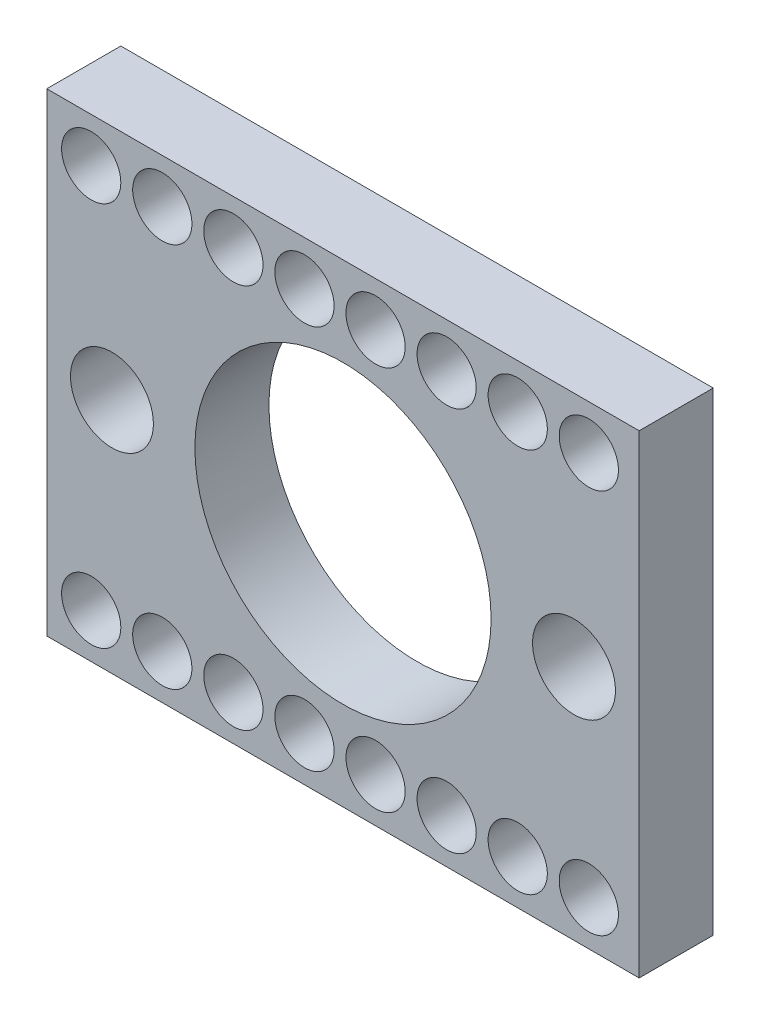
ISO-10303-21;
HEADER;
FILE_DESCRIPTION(('STEP AP214'),'2;1');
FILE_NAME('part.step','',(''),(''),'','','');
FILE_SCHEMA(('AUTOMOTIVE_DESIGN { 1 0 10303 214 1 1 1 1 }'));
ENDSEC;
DATA;
#1=APPLICATION_CONTEXT('core data for automotive mechanical design processes');
#2=APPLICATION_PROTOCOL_DEFINITION('international standard','automotive_design',2000,#1);
#3=PRODUCT_CONTEXT('',#1,'mechanical');
#4=PRODUCT('Part','Part','',(#3));
#5=PRODUCT_RELATED_PRODUCT_CATEGORY('part','',(#4));
#6=PRODUCT_DEFINITION_FORMATION('','',#4);
#7=PRODUCT_DEFINITION_CONTEXT('part definition',#1,'design');
#8=PRODUCT_DEFINITION('design','',#6,#7);
#9=PRODUCT_DEFINITION_SHAPE('','',#8);
#10=(LENGTH_UNIT() NAMED_UNIT(*) SI_UNIT(.MILLI.,.METRE.));
#11=(NAMED_UNIT(*) PLANE_ANGLE_UNIT() SI_UNIT($,.RADIAN.));
#12=(NAMED_UNIT(*) SI_UNIT($,.STERADIAN.) SOLID_ANGLE_UNIT());
#13=UNCERTAINTY_MEASURE_WITH_UNIT(LENGTH_MEASURE(1.E-05),#10,'distance_accuracy_value','');
#14=(GEOMETRIC_REPRESENTATION_CONTEXT(3) GLOBAL_UNCERTAINTY_ASSIGNED_CONTEXT((#13)) GLOBAL_UNIT_ASSIGNED_CONTEXT((#10,
#11,#12)) REPRESENTATION_CONTEXT('',''));
#15=CARTESIAN_POINT('',(0.,0.,0.));
#16=DIRECTION('',(0.,0.,1.));
#17=DIRECTION('',(1.,0.,0.));
#18=AXIS2_PLACEMENT_3D('',#15,#16,#17);
#19=CARTESIAN_POINT('',(-13.7458823529412,0.,3.175));
#20=DIRECTION('',(-1.,0.,0.));
#21=DIRECTION('',(0.,0.,1.));
#22=AXIS2_PLACEMENT_3D('',#19,#20,#21);
#23=PLANE('',#22);
#24=DIRECTION('',(0.,1.,0.));
#25=VECTOR('',#24,1.);
#26=CARTESIAN_POINT('',(-13.7458823529412,0.,0.));
#27=LINE('',#26,#25);
#28=CARTESIAN_POINT('',(-13.7458823529412,-10.16,0.));
#29=VERTEX_POINT('',#28);
#30=CARTESIAN_POINT('',(-13.7458823529412,10.16,0.));
#31=VERTEX_POINT('',#30);
#32=EDGE_CURVE('E126',#29,#31,#27,.T.);
#33=ORIENTED_EDGE('',*,*,#32,.F.);
#34=DIRECTION('',(0.,0.,-1.));
#35=VECTOR('',#34,1.);
#36=CARTESIAN_POINT('',(-13.7458823529412,-10.16,3.175));
#37=LINE('',#36,#35);
#38=CARTESIAN_POINT('',(-13.7458823529412,-10.16,3.175));
#39=VERTEX_POINT('',#38);
#40=EDGE_CURVE('E11',#39,#29,#37,.T.);
#41=ORIENTED_EDGE('',*,*,#40,.F.);
#42=DIRECTION('',(0.,1.,0.));
#43=VECTOR('',#42,1.);
#44=CARTESIAN_POINT('',(-13.7458823529412,0.,3.175));
#45=LINE('',#44,#43);
#46=CARTESIAN_POINT('',(-13.7458823529412,10.16,3.175));
#47=VERTEX_POINT('',#46);
#48=EDGE_CURVE('E103',#39,#47,#45,.T.);
#49=ORIENTED_EDGE('',*,*,#48,.T.);
#50=DIRECTION('',(0.,0.,-1.));
#51=VECTOR('',#50,1.);
#52=CARTESIAN_POINT('',(-13.7458823529412,10.16,3.175));
#53=LINE('',#52,#51);
#54=EDGE_CURVE('E80',#47,#31,#53,.T.);
#55=ORIENTED_EDGE('',*,*,#54,.T.);
#56=EDGE_LOOP('',(#33,#41,#49,#55));
#57=FACE_BOUND('',#56,.T.);
#58=ADVANCED_FACE('F39',(#57),#23,.T.);
#59=CARTESIAN_POINT('',(0.,-10.16,3.175));
#60=DIRECTION('',(0.,-1.,0.));
#61=DIRECTION('',(1.,0.,0.));
#62=AXIS2_PLACEMENT_3D('',#59,#60,#61);
#63=PLANE('',#62);
#64=DIRECTION('',(-1.,0.,0.));
#65=VECTOR('',#64,1.);
#66=CARTESIAN_POINT('',(0.,-10.16,0.));
#67=LINE('',#66,#65);
#68=CARTESIAN_POINT('',(11.6541176470588,-10.16,0.));
#69=VERTEX_POINT('',#68);
#70=EDGE_CURVE('E92',#69,#29,#67,.T.);
#71=ORIENTED_EDGE('',*,*,#70,.F.);
#72=DIRECTION('',(0.,0.,-1.));
#73=VECTOR('',#72,1.);
#74=CARTESIAN_POINT('',(11.6541176470588,-10.16,3.175));
#75=LINE('',#74,#73);
#76=CARTESIAN_POINT('',(11.6541176470588,-10.16,3.175));
#77=VERTEX_POINT('',#76);
#78=EDGE_CURVE('E49',#77,#69,#75,.T.);
#79=ORIENTED_EDGE('',*,*,#78,.F.);
#80=DIRECTION('',(-1.,0.,0.));
#81=VECTOR('',#80,1.);
#82=CARTESIAN_POINT('',(0.,-10.16,3.175));
#83=LINE('',#82,#81);
#84=EDGE_CURVE('E90',#77,#39,#83,.T.);
#85=ORIENTED_EDGE('',*,*,#84,.T.);
#86=ORIENTED_EDGE('',*,*,#40,.T.);
#87=EDGE_LOOP('',(#71,#79,#85,#86));
#88=FACE_BOUND('',#87,.T.);
#89=ADVANCED_FACE('F88',(#88),#63,.T.);
#90=CARTESIAN_POINT('',(11.6541176470588,0.,3.175));
#91=DIRECTION('',(-1.,0.,0.));
#92=DIRECTION('',(0.,-1.,0.));
#93=AXIS2_PLACEMENT_3D('',#90,#91,#92);
#94=PLANE('',#93);
#95=DIRECTION('',(0.,1.,0.));
#96=VECTOR('',#95,1.);
#97=CARTESIAN_POINT('',(11.6541176470588,0.,0.));
#98=LINE('',#97,#96);
#99=CARTESIAN_POINT('',(11.6541176470588,10.16,0.));
#100=VERTEX_POINT('',#99);
#101=EDGE_CURVE('E131',#69,#100,#98,.T.);
#102=ORIENTED_EDGE('',*,*,#101,.T.);
#103=DIRECTION('',(0.,0.,-1.));
#104=VECTOR('',#103,1.);
#105=CARTESIAN_POINT('',(11.6541176470588,10.16,3.175));
#106=LINE('',#105,#104);
#107=CARTESIAN_POINT('',(11.6541176470588,10.16,3.175));
#108=VERTEX_POINT('',#107);
#109=EDGE_CURVE('E96',#108,#100,#106,.T.);
#110=ORIENTED_EDGE('',*,*,#109,.F.);
#111=DIRECTION('',(0.,1.,0.));
#112=VECTOR('',#111,1.);
#113=CARTESIAN_POINT('',(11.6541176470588,0.,3.175));
#114=LINE('',#113,#112);
#115=EDGE_CURVE('E98',#77,#108,#114,.T.);
#116=ORIENTED_EDGE('',*,*,#115,.F.);
#117=ORIENTED_EDGE('',*,*,#78,.T.);
#118=EDGE_LOOP('',(#102,#110,#116,#117));
#119=FACE_BOUND('',#118,.T.);
#120=ADVANCED_FACE('F99',(#119),#94,.F.);
#121=CARTESIAN_POINT('',(-1.04588235294118,0.,3.175));
#122=DIRECTION('',(0.,0.,-1.));
#123=DIRECTION('',(-1.,0.,0.));
#124=AXIS2_PLACEMENT_3D('',#121,#122,#123);
#125=CYLINDRICAL_SURFACE('',#124,6.35);
#126=CARTESIAN_POINT('',(-1.04588235294118,0.,3.175));
#127=DIRECTION('',(0.,0.,1.));
#128=DIRECTION('',(1.,0.,0.));
#129=AXIS2_PLACEMENT_3D('',#126,#127,#128);
#130=CIRCLE('',#129,6.35);
#131=CARTESIAN_POINT('',(5.30411764705882,0.,3.175));
#132=VERTEX_POINT('',#131);
#133=EDGE_CURVE('E107',#132,#132,#130,.T.);
#134=ORIENTED_EDGE('',*,*,#133,.T.);
#135=EDGE_LOOP('',(#134));
#136=FACE_BOUND('',#135,.T.);
#137=CARTESIAN_POINT('',(-1.04588235294118,0.,0.));
#138=DIRECTION('',(0.,0.,1.));
#139=DIRECTION('',(1.,0.,0.));
#140=AXIS2_PLACEMENT_3D('',#137,#138,#139);
#141=CIRCLE('',#140,6.35);
#142=CARTESIAN_POINT('',(5.30411764705882,0.,0.));
#143=VERTEX_POINT('',#142);
#144=EDGE_CURVE('E122',#143,#143,#141,.T.);
#145=ORIENTED_EDGE('',*,*,#144,.F.);
#146=EDGE_LOOP('',(#145));
#147=FACE_BOUND('',#146,.T.);
#148=ADVANCED_FACE('F151',(#136,#147),#125,.F.);
#149=CARTESIAN_POINT('',(-10.9518823529412,0.,3.175));
#150=DIRECTION('',(0.,0.,-1.));
#151=DIRECTION('',(-1.,0.,0.));
#152=AXIS2_PLACEMENT_3D('',#149,#150,#151);
#153=CYLINDRICAL_SURFACE('',#152,1.778);
#154=CARTESIAN_POINT('',(-10.9518823529412,0.,3.175));
#155=DIRECTION('',(0.,0.,1.));
#156=DIRECTION('',(1.,0.,0.));
#157=AXIS2_PLACEMENT_3D('',#154,#155,#156);
#158=CIRCLE('',#157,1.778);
#159=CARTESIAN_POINT('',(-9.17388235294118,0.,3.175));
#160=VERTEX_POINT('',#159);
#161=EDGE_CURVE('E164',#160,#160,#158,.T.);
#162=ORIENTED_EDGE('',*,*,#161,.T.);
#163=EDGE_LOOP('',(#162));
#164=FACE_BOUND('',#163,.T.);
#165=CARTESIAN_POINT('',(-10.9518823529412,0.,0.));
#166=DIRECTION('',(0.,0.,1.));
#167=DIRECTION('',(1.,0.,0.));
#168=AXIS2_PLACEMENT_3D('',#165,#166,#167);
#169=CIRCLE('',#168,1.778);
#170=CARTESIAN_POINT('',(-9.17388235294118,0.,0.));
#171=VERTEX_POINT('',#170);
#172=EDGE_CURVE('E117',#171,#171,#169,.T.);
#173=ORIENTED_EDGE('',*,*,#172,.F.);
#174=EDGE_LOOP('',(#173));
#175=FACE_BOUND('',#174,.T.);
#176=ADVANCED_FACE('F153',(#164,#175),#153,.F.);
#177=CARTESIAN_POINT('',(8.86011764705882,0.,3.175));
#178=DIRECTION('',(0.,0.,-1.));
#179=DIRECTION('',(-1.,0.,0.));
#180=AXIS2_PLACEMENT_3D('',#177,#178,#179);
#181=CYLINDRICAL_SURFACE('',#180,1.778);
#182=CARTESIAN_POINT('',(8.86011764705882,0.,3.175));
#183=DIRECTION('',(0.,0.,1.));
#184=DIRECTION('',(1.,0.,0.));
#185=AXIS2_PLACEMENT_3D('',#182,#183,#184);
#186=CIRCLE('',#185,1.778);
#187=CARTESIAN_POINT('',(10.6381176470588,0.,3.175));
#188=VERTEX_POINT('',#187);
#189=EDGE_CURVE('E136',#188,#188,#186,.T.);
#190=ORIENTED_EDGE('',*,*,#189,.T.);
#191=EDGE_LOOP('',(#190));
#192=FACE_BOUND('',#191,.T.);
#193=CARTESIAN_POINT('',(8.86011764705882,0.,0.));
#194=DIRECTION('',(0.,0.,1.));
#195=DIRECTION('',(1.,0.,0.));
#196=AXIS2_PLACEMENT_3D('',#193,#194,#195);
#197=CIRCLE('',#196,1.778);
#198=CARTESIAN_POINT('',(10.6381176470588,0.,0.));
#199=VERTEX_POINT('',#198);
#200=EDGE_CURVE('E113',#199,#199,#197,.T.);
#201=ORIENTED_EDGE('',*,*,#200,.F.);
#202=EDGE_LOOP('',(#201));
#203=FACE_BOUND('',#202,.T.);
#204=ADVANCED_FACE('F41',(#192,#203),#181,.F.);
#205=CARTESIAN_POINT('',(0.,10.16,3.175));
#206=DIRECTION('',(0.,-1.,0.));
#207=DIRECTION('',(1.,0.,0.));
#208=AXIS2_PLACEMENT_3D('',#205,#206,#207);
#209=PLANE('',#208);
#210=DIRECTION('',(-1.,0.,0.));
#211=VECTOR('',#210,1.);
#212=CARTESIAN_POINT('',(0.,10.16,0.));
#213=LINE('',#212,#211);
#214=EDGE_CURVE('E73',#100,#31,#213,.T.);
#215=ORIENTED_EDGE('',*,*,#214,.T.);
#216=ORIENTED_EDGE('',*,*,#54,.F.);
#217=DIRECTION('',(-1.,0.,0.));
#218=VECTOR('',#217,1.);
#219=CARTESIAN_POINT('',(0.,10.16,3.175));
#220=LINE('',#219,#218);
#221=EDGE_CURVE('E57',#108,#47,#220,.T.);
#222=ORIENTED_EDGE('',*,*,#221,.F.);
#223=ORIENTED_EDGE('',*,*,#109,.T.);
#224=EDGE_LOOP('',(#215,#216,#222,#223));
#225=FACE_BOUND('',#224,.T.);
#226=ADVANCED_FACE('F141',(#225),#209,.F.);
#227=CARTESIAN_POINT('',(0.,0.,3.175));
#228=DIRECTION('',(0.,0.,1.));
#229=DIRECTION('',(1.,0.,0.));
#230=AXIS2_PLACEMENT_3D('',#227,#228,#229);
#231=PLANE('',#230);
#232=CARTESIAN_POINT('',(-11.8408823529412,-8.255,3.175));
#233=DIRECTION('',(0.,0.,1.));
#234=DIRECTION('',(1.,0.,0.));
#235=AXIS2_PLACEMENT_3D('',#232,#233,#234);
#236=CIRCLE('',#235,1.27);
#237=CARTESIAN_POINT('',(-10.5708823529412,-8.255,3.175));
#238=VERTEX_POINT('',#237);
#239=EDGE_CURVE('E388',#238,#238,#236,.T.);
#240=ORIENTED_EDGE('',*,*,#239,.F.);
#241=EDGE_LOOP('',(#240));
#242=FACE_BOUND('',#241,.T.);
#243=CARTESIAN_POINT('',(-8.79288235294118,8.255,3.175));
#244=DIRECTION('',(0.,0.,1.));
#245=DIRECTION('',(1.,0.,0.));
#246=AXIS2_PLACEMENT_3D('',#243,#244,#245);
#247=CIRCLE('',#246,1.27);
#248=CARTESIAN_POINT('',(-7.52288235294118,8.255,3.175));
#249=VERTEX_POINT('',#248);
#250=EDGE_CURVE('E397',#249,#249,#247,.T.);
#251=ORIENTED_EDGE('',*,*,#250,.F.);
#252=EDGE_LOOP('',(#251));
#253=FACE_BOUND('',#252,.T.);
#254=CARTESIAN_POINT('',(-5.74488235294118,8.255,3.175));
#255=DIRECTION('',(0.,0.,1.));
#256=DIRECTION('',(1.,0.,0.));
#257=AXIS2_PLACEMENT_3D('',#254,#255,#256);
#258=CIRCLE('',#257,1.27);
#259=CARTESIAN_POINT('',(-4.47488235294118,8.255,3.175));
#260=VERTEX_POINT('',#259);
#261=EDGE_CURVE('E408',#260,#260,#258,.T.);
#262=ORIENTED_EDGE('',*,*,#261,.F.);
#263=EDGE_LOOP('',(#262));
#264=FACE_BOUND('',#263,.T.);
#265=CARTESIAN_POINT('',(-2.69688235294118,8.255,3.175));
#266=DIRECTION('',(0.,0.,1.));
#267=DIRECTION('',(1.,0.,0.));
#268=AXIS2_PLACEMENT_3D('',#265,#266,#267);
#269=CIRCLE('',#268,1.27);
#270=CARTESIAN_POINT('',(-1.42688235294118,8.255,3.175));
#271=VERTEX_POINT('',#270);
#272=EDGE_CURVE('E416',#271,#271,#269,.T.);
#273=ORIENTED_EDGE('',*,*,#272,.F.);
#274=EDGE_LOOP('',(#273));
#275=FACE_BOUND('',#274,.T.);
#276=CARTESIAN_POINT('',(0.351117647058818,8.255,3.175));
#277=DIRECTION('',(0.,0.,1.));
#278=DIRECTION('',(1.,0.,0.));
#279=AXIS2_PLACEMENT_3D('',#276,#277,#278);
#280=CIRCLE('',#279,1.27);
#281=CARTESIAN_POINT('',(1.62111764705882,8.255,3.175));
#282=VERTEX_POINT('',#281);
#283=EDGE_CURVE('E424',#282,#282,#280,.T.);
#284=ORIENTED_EDGE('',*,*,#283,.F.);
#285=EDGE_LOOP('',(#284));
#286=FACE_BOUND('',#285,.T.);
#287=CARTESIAN_POINT('',(3.39911764705882,8.255,3.175));
#288=DIRECTION('',(0.,0.,1.));
#289=DIRECTION('',(1.,0.,0.));
#290=AXIS2_PLACEMENT_3D('',#287,#288,#289);
#291=CIRCLE('',#290,1.27);
#292=CARTESIAN_POINT('',(4.66911764705882,8.255,3.175));
#293=VERTEX_POINT('',#292);
#294=EDGE_CURVE('E432',#293,#293,#291,.T.);
#295=ORIENTED_EDGE('',*,*,#294,.F.);
#296=EDGE_LOOP('',(#295));
#297=FACE_BOUND('',#296,.T.);
#298=CARTESIAN_POINT('',(6.44711764705882,8.255,3.175));
#299=DIRECTION('',(0.,0.,1.));
#300=DIRECTION('',(1.,0.,0.));
#301=AXIS2_PLACEMENT_3D('',#298,#299,#300);
#302=CIRCLE('',#301,1.27);
#303=CARTESIAN_POINT('',(7.71711764705882,8.255,3.175));
#304=VERTEX_POINT('',#303);
#305=EDGE_CURVE('E440',#304,#304,#302,.T.);
#306=ORIENTED_EDGE('',*,*,#305,.F.);
#307=EDGE_LOOP('',(#306));
#308=FACE_BOUND('',#307,.T.);
#309=CARTESIAN_POINT('',(9.49511764705882,8.255,3.175));
#310=DIRECTION('',(0.,0.,1.));
#311=DIRECTION('',(1.,0.,0.));
#312=AXIS2_PLACEMENT_3D('',#309,#310,#311);
#313=CIRCLE('',#312,1.27);
#314=CARTESIAN_POINT('',(10.7651176470588,8.255,3.175));
#315=VERTEX_POINT('',#314);
#316=EDGE_CURVE('E448',#315,#315,#313,.T.);
#317=ORIENTED_EDGE('',*,*,#316,.F.);
#318=EDGE_LOOP('',(#317));
#319=FACE_BOUND('',#318,.T.);
#320=CARTESIAN_POINT('',(-8.79288235294118,-8.255,3.175));
#321=DIRECTION('',(0.,0.,1.));
#322=DIRECTION('',(1.,0.,0.));
#323=AXIS2_PLACEMENT_3D('',#320,#321,#322);
#324=CIRCLE('',#323,1.27);
#325=CARTESIAN_POINT('',(-7.52288235294118,-8.255,3.175));
#326=VERTEX_POINT('',#325);
#327=EDGE_CURVE('E482',#326,#326,#324,.T.);
#328=ORIENTED_EDGE('',*,*,#327,.F.);
#329=EDGE_LOOP('',(#328));
#330=FACE_BOUND('',#329,.T.);
#331=CARTESIAN_POINT('',(-5.74488235294118,-8.255,3.175));
#332=DIRECTION('',(0.,0.,1.));
#333=DIRECTION('',(1.,0.,0.));
#334=AXIS2_PLACEMENT_3D('',#331,#332,#333);
#335=CIRCLE('',#334,1.27);
#336=CARTESIAN_POINT('',(-4.47488235294118,-8.255,3.175));
#337=VERTEX_POINT('',#336);
#338=EDGE_CURVE('E494',#337,#337,#335,.T.);
#339=ORIENTED_EDGE('',*,*,#338,.F.);
#340=EDGE_LOOP('',(#339));
#341=FACE_BOUND('',#340,.T.);
#342=CARTESIAN_POINT('',(-2.69688235294118,-8.255,3.175));
#343=DIRECTION('',(0.,0.,1.));
#344=DIRECTION('',(1.,0.,0.));
#345=AXIS2_PLACEMENT_3D('',#342,#343,#344);
#346=CIRCLE('',#345,1.27);
#347=CARTESIAN_POINT('',(-1.42688235294118,-8.255,3.175));
#348=VERTEX_POINT('',#347);
#349=EDGE_CURVE('E502',#348,#348,#346,.T.);
#350=ORIENTED_EDGE('',*,*,#349,.F.);
#351=EDGE_LOOP('',(#350));
#352=FACE_BOUND('',#351,.T.);
#353=CARTESIAN_POINT('',(0.351117647058818,-8.255,3.175));
#354=DIRECTION('',(0.,0.,1.));
#355=DIRECTION('',(1.,0.,0.));
#356=AXIS2_PLACEMENT_3D('',#353,#354,#355);
#357=CIRCLE('',#356,1.27);
#358=CARTESIAN_POINT('',(1.62111764705882,-8.255,3.175));
#359=VERTEX_POINT('',#358);
#360=EDGE_CURVE('E510',#359,#359,#357,.T.);
#361=ORIENTED_EDGE('',*,*,#360,.F.);
#362=EDGE_LOOP('',(#361));
#363=FACE_BOUND('',#362,.T.);
#364=CARTESIAN_POINT('',(3.39911764705882,-8.255,3.175));
#365=DIRECTION('',(0.,0.,1.));
#366=DIRECTION('',(1.,0.,0.));
#367=AXIS2_PLACEMENT_3D('',#364,#365,#366);
#368=CIRCLE('',#367,1.27);
#369=CARTESIAN_POINT('',(4.66911764705882,-8.255,3.175));
#370=VERTEX_POINT('',#369);
#371=EDGE_CURVE('E518',#370,#370,#368,.T.);
#372=ORIENTED_EDGE('',*,*,#371,.F.);
#373=EDGE_LOOP('',(#372));
#374=FACE_BOUND('',#373,.T.);
#375=CARTESIAN_POINT('',(6.44711764705882,-8.255,3.175));
#376=DIRECTION('',(0.,0.,1.));
#377=DIRECTION('',(1.,0.,0.));
#378=AXIS2_PLACEMENT_3D('',#375,#376,#377);
#379=CIRCLE('',#378,1.27);
#380=CARTESIAN_POINT('',(7.71711764705882,-8.255,3.175));
#381=VERTEX_POINT('',#380);
#382=EDGE_CURVE('E526',#381,#381,#379,.T.);
#383=ORIENTED_EDGE('',*,*,#382,.F.);
#384=EDGE_LOOP('',(#383));
#385=FACE_BOUND('',#384,.T.);
#386=CARTESIAN_POINT('',(9.49511764705882,-8.255,3.175));
#387=DIRECTION('',(0.,0.,1.));
#388=DIRECTION('',(1.,0.,0.));
#389=AXIS2_PLACEMENT_3D('',#386,#387,#388);
#390=CIRCLE('',#389,1.27);
#391=CARTESIAN_POINT('',(10.7651176470588,-8.255,3.175));
#392=VERTEX_POINT('',#391);
#393=EDGE_CURVE('E533',#392,#392,#390,.T.);
#394=ORIENTED_EDGE('',*,*,#393,.F.);
#395=EDGE_LOOP('',(#394));
#396=FACE_BOUND('',#395,.T.);
#397=CARTESIAN_POINT('',(-11.8408823529412,8.255,3.175));
#398=DIRECTION('',(0.,0.,1.));
#399=DIRECTION('',(1.,0.,0.));
#400=AXIS2_PLACEMENT_3D('',#397,#398,#399);
#401=CIRCLE('',#400,1.27);
#402=CARTESIAN_POINT('',(-10.5708823529412,8.255,3.175));
#403=VERTEX_POINT('',#402);
#404=EDGE_CURVE('E394',#403,#403,#401,.T.);
#405=ORIENTED_EDGE('',*,*,#404,.F.);
#406=EDGE_LOOP('',(#405));
#407=FACE_BOUND('',#406,.T.);
#408=ORIENTED_EDGE('',*,*,#189,.F.);
#409=EDGE_LOOP('',(#408));
#410=FACE_BOUND('',#409,.T.);
#411=ORIENTED_EDGE('',*,*,#161,.F.);
#412=EDGE_LOOP('',(#411));
#413=FACE_BOUND('',#412,.T.);
#414=ORIENTED_EDGE('',*,*,#133,.F.);
#415=EDGE_LOOP('',(#414));
#416=FACE_BOUND('',#415,.T.);
#417=ORIENTED_EDGE('',*,*,#48,.F.);
#418=ORIENTED_EDGE('',*,*,#84,.F.);
#419=ORIENTED_EDGE('',*,*,#115,.T.);
#420=ORIENTED_EDGE('',*,*,#221,.T.);
#421=EDGE_LOOP('',(#417,#418,#419,#420));
#422=FACE_BOUND('',#421,.T.);
#423=ADVANCED_FACE('F102',(#242,#253,#264,#275,#286,#297,#308,#319,#330,#341,#352,#363,#374,
#385,#396,#407,#410,#413,#416,#422),#231,.T.);
#424=CARTESIAN_POINT('',(0.,0.,0.));
#425=DIRECTION('',(0.,0.,1.));
#426=DIRECTION('',(1.,0.,0.));
#427=AXIS2_PLACEMENT_3D('',#424,#425,#426);
#428=PLANE('',#427);
#429=CARTESIAN_POINT('',(-11.8408823529412,-8.255,0.));
#430=DIRECTION('',(0.,0.,1.));
#431=DIRECTION('',(1.,0.,0.));
#432=AXIS2_PLACEMENT_3D('',#429,#430,#431);
#433=CIRCLE('',#432,1.27);
#434=CARTESIAN_POINT('',(-10.5708823529412,-8.255,0.));
#435=VERTEX_POINT('',#434);
#436=EDGE_CURVE('E385',#435,#435,#433,.T.);
#437=ORIENTED_EDGE('',*,*,#436,.T.);
#438=EDGE_LOOP('',(#437));
#439=FACE_BOUND('',#438,.T.);
#440=CARTESIAN_POINT('',(-8.79288235294118,8.255,0.));
#441=DIRECTION('',(0.,0.,1.));
#442=DIRECTION('',(1.,0.,0.));
#443=AXIS2_PLACEMENT_3D('',#440,#441,#442);
#444=CIRCLE('',#443,1.27);
#445=CARTESIAN_POINT('',(-7.52288235294118,8.255,0.));
#446=VERTEX_POINT('',#445);
#447=EDGE_CURVE('E390',#446,#446,#444,.T.);
#448=ORIENTED_EDGE('',*,*,#447,.T.);
#449=EDGE_LOOP('',(#448));
#450=FACE_BOUND('',#449,.T.);
#451=CARTESIAN_POINT('',(-5.74488235294118,8.255,0.));
#452=DIRECTION('',(0.,0.,1.));
#453=DIRECTION('',(1.,0.,0.));
#454=AXIS2_PLACEMENT_3D('',#451,#452,#453);
#455=CIRCLE('',#454,1.27);
#456=CARTESIAN_POINT('',(-4.47488235294118,8.255,0.));
#457=VERTEX_POINT('',#456);
#458=EDGE_CURVE('E404',#457,#457,#455,.T.);
#459=ORIENTED_EDGE('',*,*,#458,.T.);
#460=EDGE_LOOP('',(#459));
#461=FACE_BOUND('',#460,.T.);
#462=CARTESIAN_POINT('',(-2.69688235294118,8.255,0.));
#463=DIRECTION('',(0.,0.,1.));
#464=DIRECTION('',(1.,0.,0.));
#465=AXIS2_PLACEMENT_3D('',#462,#463,#464);
#466=CIRCLE('',#465,1.27);
#467=CARTESIAN_POINT('',(-1.42688235294118,8.255,0.));
#468=VERTEX_POINT('',#467);
#469=EDGE_CURVE('E412',#468,#468,#466,.T.);
#470=ORIENTED_EDGE('',*,*,#469,.T.);
#471=EDGE_LOOP('',(#470));
#472=FACE_BOUND('',#471,.T.);
#473=CARTESIAN_POINT('',(0.351117647058818,8.255,0.));
#474=DIRECTION('',(0.,0.,1.));
#475=DIRECTION('',(1.,0.,0.));
#476=AXIS2_PLACEMENT_3D('',#473,#474,#475);
#477=CIRCLE('',#476,1.27);
#478=CARTESIAN_POINT('',(1.62111764705882,8.255,0.));
#479=VERTEX_POINT('',#478);
#480=EDGE_CURVE('E420',#479,#479,#477,.T.);
#481=ORIENTED_EDGE('',*,*,#480,.T.);
#482=EDGE_LOOP('',(#481));
#483=FACE_BOUND('',#482,.T.);
#484=CARTESIAN_POINT('',(3.39911764705882,8.255,0.));
#485=DIRECTION('',(0.,0.,1.));
#486=DIRECTION('',(1.,0.,0.));
#487=AXIS2_PLACEMENT_3D('',#484,#485,#486);
#488=CIRCLE('',#487,1.27);
#489=CARTESIAN_POINT('',(4.66911764705882,8.255,0.));
#490=VERTEX_POINT('',#489);
#491=EDGE_CURVE('E428',#490,#490,#488,.T.);
#492=ORIENTED_EDGE('',*,*,#491,.T.);
#493=EDGE_LOOP('',(#492));
#494=FACE_BOUND('',#493,.T.);
#495=CARTESIAN_POINT('',(6.44711764705882,8.255,0.));
#496=DIRECTION('',(0.,0.,1.));
#497=DIRECTION('',(1.,0.,0.));
#498=AXIS2_PLACEMENT_3D('',#495,#496,#497);
#499=CIRCLE('',#498,1.27);
#500=CARTESIAN_POINT('',(7.71711764705882,8.255,0.));
#501=VERTEX_POINT('',#500);
#502=EDGE_CURVE('E436',#501,#501,#499,.T.);
#503=ORIENTED_EDGE('',*,*,#502,.T.);
#504=EDGE_LOOP('',(#503));
#505=FACE_BOUND('',#504,.T.);
#506=CARTESIAN_POINT('',(9.49511764705882,8.255,0.));
#507=DIRECTION('',(0.,0.,1.));
#508=DIRECTION('',(1.,0.,0.));
#509=AXIS2_PLACEMENT_3D('',#506,#507,#508);
#510=CIRCLE('',#509,1.27);
#511=CARTESIAN_POINT('',(10.7651176470588,8.255,0.));
#512=VERTEX_POINT('',#511);
#513=EDGE_CURVE('E444',#512,#512,#510,.T.);
#514=ORIENTED_EDGE('',*,*,#513,.T.);
#515=EDGE_LOOP('',(#514));
#516=FACE_BOUND('',#515,.T.);
#517=CARTESIAN_POINT('',(-8.79288235294118,-8.255,0.));
#518=DIRECTION('',(0.,0.,1.));
#519=DIRECTION('',(1.,0.,0.));
#520=AXIS2_PLACEMENT_3D('',#517,#518,#519);
#521=CIRCLE('',#520,1.27);
#522=CARTESIAN_POINT('',(-7.52288235294118,-8.255,0.));
#523=VERTEX_POINT('',#522);
#524=EDGE_CURVE('E452',#523,#523,#521,.T.);
#525=ORIENTED_EDGE('',*,*,#524,.T.);
#526=EDGE_LOOP('',(#525));
#527=FACE_BOUND('',#526,.T.);
#528=CARTESIAN_POINT('',(-5.74488235294118,-8.255,0.));
#529=DIRECTION('',(0.,0.,1.));
#530=DIRECTION('',(1.,0.,0.));
#531=AXIS2_PLACEMENT_3D('',#528,#529,#530);
#532=CIRCLE('',#531,1.27);
#533=CARTESIAN_POINT('',(-4.47488235294118,-8.255,0.));
#534=VERTEX_POINT('',#533);
#535=EDGE_CURVE('E488',#534,#534,#532,.T.);
#536=ORIENTED_EDGE('',*,*,#535,.T.);
#537=EDGE_LOOP('',(#536));
#538=FACE_BOUND('',#537,.T.);
#539=CARTESIAN_POINT('',(-2.69688235294118,-8.255,0.));
#540=DIRECTION('',(0.,0.,1.));
#541=DIRECTION('',(1.,0.,0.));
#542=AXIS2_PLACEMENT_3D('',#539,#540,#541);
#543=CIRCLE('',#542,1.27);
#544=CARTESIAN_POINT('',(-1.42688235294118,-8.255,0.));
#545=VERTEX_POINT('',#544);
#546=EDGE_CURVE('E498',#545,#545,#543,.T.);
#547=ORIENTED_EDGE('',*,*,#546,.T.);
#548=EDGE_LOOP('',(#547));
#549=FACE_BOUND('',#548,.T.);
#550=CARTESIAN_POINT('',(0.351117647058818,-8.255,0.));
#551=DIRECTION('',(0.,0.,1.));
#552=DIRECTION('',(1.,0.,0.));
#553=AXIS2_PLACEMENT_3D('',#550,#551,#552);
#554=CIRCLE('',#553,1.27);
#555=CARTESIAN_POINT('',(1.62111764705882,-8.255,0.));
#556=VERTEX_POINT('',#555);
#557=EDGE_CURVE('E506',#556,#556,#554,.T.);
#558=ORIENTED_EDGE('',*,*,#557,.T.);
#559=EDGE_LOOP('',(#558));
#560=FACE_BOUND('',#559,.T.);
#561=CARTESIAN_POINT('',(3.39911764705882,-8.255,0.));
#562=DIRECTION('',(0.,0.,1.));
#563=DIRECTION('',(1.,0.,0.));
#564=AXIS2_PLACEMENT_3D('',#561,#562,#563);
#565=CIRCLE('',#564,1.27);
#566=CARTESIAN_POINT('',(4.66911764705882,-8.255,0.));
#567=VERTEX_POINT('',#566);
#568=EDGE_CURVE('E514',#567,#567,#565,.T.);
#569=ORIENTED_EDGE('',*,*,#568,.T.);
#570=EDGE_LOOP('',(#569));
#571=FACE_BOUND('',#570,.T.);
#572=CARTESIAN_POINT('',(6.44711764705882,-8.255,0.));
#573=DIRECTION('',(0.,0.,1.));
#574=DIRECTION('',(1.,0.,0.));
#575=AXIS2_PLACEMENT_3D('',#572,#573,#574);
#576=CIRCLE('',#575,1.27);
#577=CARTESIAN_POINT('',(7.71711764705882,-8.255,0.));
#578=VERTEX_POINT('',#577);
#579=EDGE_CURVE('E522',#578,#578,#576,.T.);
#580=ORIENTED_EDGE('',*,*,#579,.T.);
#581=EDGE_LOOP('',(#580));
#582=FACE_BOUND('',#581,.T.);
#583=CARTESIAN_POINT('',(9.49511764705882,-8.255,0.));
#584=DIRECTION('',(0.,0.,1.));
#585=DIRECTION('',(1.,0.,0.));
#586=AXIS2_PLACEMENT_3D('',#583,#584,#585);
#587=CIRCLE('',#586,1.27);
#588=CARTESIAN_POINT('',(10.7651176470588,-8.255,0.));
#589=VERTEX_POINT('',#588);
#590=EDGE_CURVE('E530',#589,#589,#587,.T.);
#591=ORIENTED_EDGE('',*,*,#590,.T.);
#592=EDGE_LOOP('',(#591));
#593=FACE_BOUND('',#592,.T.);
#594=CARTESIAN_POINT('',(-11.8408823529412,8.255,0.));
#595=DIRECTION('',(0.,0.,1.));
#596=DIRECTION('',(1.,0.,0.));
#597=AXIS2_PLACEMENT_3D('',#594,#595,#596);
#598=CIRCLE('',#597,1.27);
#599=CARTESIAN_POINT('',(-10.5708823529412,8.255,0.));
#600=VERTEX_POINT('',#599);
#601=EDGE_CURVE('E118',#600,#600,#598,.T.);
#602=ORIENTED_EDGE('',*,*,#601,.T.);
#603=EDGE_LOOP('',(#602));
#604=FACE_BOUND('',#603,.T.);
#605=ORIENTED_EDGE('',*,*,#200,.T.);
#606=EDGE_LOOP('',(#605));
#607=FACE_BOUND('',#606,.T.);
#608=ORIENTED_EDGE('',*,*,#172,.T.);
#609=EDGE_LOOP('',(#608));
#610=FACE_BOUND('',#609,.T.);
#611=ORIENTED_EDGE('',*,*,#144,.T.);
#612=EDGE_LOOP('',(#611));
#613=FACE_BOUND('',#612,.T.);
#614=ORIENTED_EDGE('',*,*,#32,.T.);
#615=ORIENTED_EDGE('',*,*,#214,.F.);
#616=ORIENTED_EDGE('',*,*,#101,.F.);
#617=ORIENTED_EDGE('',*,*,#70,.T.);
#618=EDGE_LOOP('',(#614,#615,#616,#617));
#619=FACE_BOUND('',#618,.T.);
#620=ADVANCED_FACE('F142',(#439,#450,#461,#472,#483,#494,#505,#516,#527,#538,#549,#560,#571,
#582,#593,#604,#607,#610,#613,#619),#428,.F.);
#621=CARTESIAN_POINT('',(-11.8408823529412,8.255,0.));
#622=DIRECTION('',(0.,0.,1.));
#623=DIRECTION('',(1.,0.,0.));
#624=AXIS2_PLACEMENT_3D('',#621,#622,#623);
#625=CYLINDRICAL_SURFACE('',#624,1.27);
#626=ORIENTED_EDGE('',*,*,#601,.F.);
#627=EDGE_LOOP('',(#626));
#628=FACE_BOUND('',#627,.T.);
#629=ORIENTED_EDGE('',*,*,#404,.T.);
#630=EDGE_LOOP('',(#629));
#631=FACE_BOUND('',#630,.T.);
#632=ADVANCED_FACE('F169',(#628,#631),#625,.F.);
#633=CARTESIAN_POINT('',(9.49511764705882,-8.255,0.));
#634=DIRECTION('',(0.,0.,1.));
#635=DIRECTION('',(1.,0.,0.));
#636=AXIS2_PLACEMENT_3D('',#633,#634,#635);
#637=CYLINDRICAL_SURFACE('',#636,1.27);
#638=ORIENTED_EDGE('',*,*,#590,.F.);
#639=EDGE_LOOP('',(#638));
#640=FACE_BOUND('',#639,.T.);
#641=ORIENTED_EDGE('',*,*,#393,.T.);
#642=EDGE_LOOP('',(#641));
#643=FACE_BOUND('',#642,.T.);
#644=ADVANCED_FACE('F178',(#640,#643),#637,.F.);
#645=CARTESIAN_POINT('',(6.44711764705882,-8.255,0.));
#646=DIRECTION('',(0.,0.,1.));
#647=DIRECTION('',(1.,0.,0.));
#648=AXIS2_PLACEMENT_3D('',#645,#646,#647);
#649=CYLINDRICAL_SURFACE('',#648,1.27);
#650=ORIENTED_EDGE('',*,*,#579,.F.);
#651=EDGE_LOOP('',(#650));
#652=FACE_BOUND('',#651,.T.);
#653=ORIENTED_EDGE('',*,*,#382,.T.);
#654=EDGE_LOOP('',(#653));
#655=FACE_BOUND('',#654,.T.);
#656=ADVANCED_FACE('F239',(#652,#655),#649,.F.);
#657=CARTESIAN_POINT('',(3.39911764705882,-8.255,0.));
#658=DIRECTION('',(0.,0.,1.));
#659=DIRECTION('',(1.,0.,0.));
#660=AXIS2_PLACEMENT_3D('',#657,#658,#659);
#661=CYLINDRICAL_SURFACE('',#660,1.27);
#662=ORIENTED_EDGE('',*,*,#568,.F.);
#663=EDGE_LOOP('',(#662));
#664=FACE_BOUND('',#663,.T.);
#665=ORIENTED_EDGE('',*,*,#371,.T.);
#666=EDGE_LOOP('',(#665));
#667=FACE_BOUND('',#666,.T.);
#668=ADVANCED_FACE('F249',(#664,#667),#661,.F.);
#669=CARTESIAN_POINT('',(0.351117647058818,-8.255,0.));
#670=DIRECTION('',(0.,0.,1.));
#671=DIRECTION('',(1.,0.,0.));
#672=AXIS2_PLACEMENT_3D('',#669,#670,#671);
#673=CYLINDRICAL_SURFACE('',#672,1.27);
#674=ORIENTED_EDGE('',*,*,#557,.F.);
#675=EDGE_LOOP('',(#674));
#676=FACE_BOUND('',#675,.T.);
#677=ORIENTED_EDGE('',*,*,#360,.T.);
#678=EDGE_LOOP('',(#677));
#679=FACE_BOUND('',#678,.T.);
#680=ADVANCED_FACE('F259',(#676,#679),#673,.F.);
#681=CARTESIAN_POINT('',(-2.69688235294118,-8.255,0.));
#682=DIRECTION('',(0.,0.,1.));
#683=DIRECTION('',(1.,0.,0.));
#684=AXIS2_PLACEMENT_3D('',#681,#682,#683);
#685=CYLINDRICAL_SURFACE('',#684,1.27);
#686=ORIENTED_EDGE('',*,*,#546,.F.);
#687=EDGE_LOOP('',(#686));
#688=FACE_BOUND('',#687,.T.);
#689=ORIENTED_EDGE('',*,*,#349,.T.);
#690=EDGE_LOOP('',(#689));
#691=FACE_BOUND('',#690,.T.);
#692=ADVANCED_FACE('F269',(#688,#691),#685,.F.);
#693=CARTESIAN_POINT('',(-5.74488235294118,-8.255,0.));
#694=DIRECTION('',(0.,0.,1.));
#695=DIRECTION('',(1.,0.,0.));
#696=AXIS2_PLACEMENT_3D('',#693,#694,#695);
#697=CYLINDRICAL_SURFACE('',#696,1.27);
#698=ORIENTED_EDGE('',*,*,#535,.F.);
#699=EDGE_LOOP('',(#698));
#700=FACE_BOUND('',#699,.T.);
#701=ORIENTED_EDGE('',*,*,#338,.T.);
#702=EDGE_LOOP('',(#701));
#703=FACE_BOUND('',#702,.T.);
#704=ADVANCED_FACE('F279',(#700,#703),#697,.F.);
#705=CARTESIAN_POINT('',(-8.79288235294118,-8.255,0.));
#706=DIRECTION('',(0.,0.,1.));
#707=DIRECTION('',(1.,0.,0.));
#708=AXIS2_PLACEMENT_3D('',#705,#706,#707);
#709=CYLINDRICAL_SURFACE('',#708,1.27);
#710=ORIENTED_EDGE('',*,*,#524,.F.);
#711=EDGE_LOOP('',(#710));
#712=FACE_BOUND('',#711,.T.);
#713=ORIENTED_EDGE('',*,*,#327,.T.);
#714=EDGE_LOOP('',(#713));
#715=FACE_BOUND('',#714,.T.);
#716=ADVANCED_FACE('F289',(#712,#715),#709,.F.);
#717=CARTESIAN_POINT('',(9.49511764705882,8.255,0.));
#718=DIRECTION('',(0.,0.,1.));
#719=DIRECTION('',(1.,0.,0.));
#720=AXIS2_PLACEMENT_3D('',#717,#718,#719);
#721=CYLINDRICAL_SURFACE('',#720,1.27);
#722=ORIENTED_EDGE('',*,*,#513,.F.);
#723=EDGE_LOOP('',(#722));
#724=FACE_BOUND('',#723,.T.);
#725=ORIENTED_EDGE('',*,*,#316,.T.);
#726=EDGE_LOOP('',(#725));
#727=FACE_BOUND('',#726,.T.);
#728=ADVANCED_FACE('F299',(#724,#727),#721,.F.);
#729=CARTESIAN_POINT('',(6.44711764705882,8.255,0.));
#730=DIRECTION('',(0.,0.,1.));
#731=DIRECTION('',(1.,0.,0.));
#732=AXIS2_PLACEMENT_3D('',#729,#730,#731);
#733=CYLINDRICAL_SURFACE('',#732,1.27);
#734=ORIENTED_EDGE('',*,*,#502,.F.);
#735=EDGE_LOOP('',(#734));
#736=FACE_BOUND('',#735,.T.);
#737=ORIENTED_EDGE('',*,*,#305,.T.);
#738=EDGE_LOOP('',(#737));
#739=FACE_BOUND('',#738,.T.);
#740=ADVANCED_FACE('F309',(#736,#739),#733,.F.);
#741=CARTESIAN_POINT('',(3.39911764705882,8.255,0.));
#742=DIRECTION('',(0.,0.,1.));
#743=DIRECTION('',(1.,0.,0.));
#744=AXIS2_PLACEMENT_3D('',#741,#742,#743);
#745=CYLINDRICAL_SURFACE('',#744,1.27);
#746=ORIENTED_EDGE('',*,*,#491,.F.);
#747=EDGE_LOOP('',(#746));
#748=FACE_BOUND('',#747,.T.);
#749=ORIENTED_EDGE('',*,*,#294,.T.);
#750=EDGE_LOOP('',(#749));
#751=FACE_BOUND('',#750,.T.);
#752=ADVANCED_FACE('F319',(#748,#751),#745,.F.);
#753=CARTESIAN_POINT('',(0.351117647058818,8.255,0.));
#754=DIRECTION('',(0.,0.,1.));
#755=DIRECTION('',(1.,0.,0.));
#756=AXIS2_PLACEMENT_3D('',#753,#754,#755);
#757=CYLINDRICAL_SURFACE('',#756,1.27);
#758=ORIENTED_EDGE('',*,*,#480,.F.);
#759=EDGE_LOOP('',(#758));
#760=FACE_BOUND('',#759,.T.);
#761=ORIENTED_EDGE('',*,*,#283,.T.);
#762=EDGE_LOOP('',(#761));
#763=FACE_BOUND('',#762,.T.);
#764=ADVANCED_FACE('F329',(#760,#763),#757,.F.);
#765=CARTESIAN_POINT('',(-2.69688235294118,8.255,0.));
#766=DIRECTION('',(0.,0.,1.));
#767=DIRECTION('',(1.,0.,0.));
#768=AXIS2_PLACEMENT_3D('',#765,#766,#767);
#769=CYLINDRICAL_SURFACE('',#768,1.27);
#770=ORIENTED_EDGE('',*,*,#469,.F.);
#771=EDGE_LOOP('',(#770));
#772=FACE_BOUND('',#771,.T.);
#773=ORIENTED_EDGE('',*,*,#272,.T.);
#774=EDGE_LOOP('',(#773));
#775=FACE_BOUND('',#774,.T.);
#776=ADVANCED_FACE('F339',(#772,#775),#769,.F.);
#777=CARTESIAN_POINT('',(-5.74488235294118,8.255,0.));
#778=DIRECTION('',(0.,0.,1.));
#779=DIRECTION('',(1.,0.,0.));
#780=AXIS2_PLACEMENT_3D('',#777,#778,#779);
#781=CYLINDRICAL_SURFACE('',#780,1.27);
#782=ORIENTED_EDGE('',*,*,#458,.F.);
#783=EDGE_LOOP('',(#782));
#784=FACE_BOUND('',#783,.T.);
#785=ORIENTED_EDGE('',*,*,#261,.T.);
#786=EDGE_LOOP('',(#785));
#787=FACE_BOUND('',#786,.T.);
#788=ADVANCED_FACE('F349',(#784,#787),#781,.F.);
#789=CARTESIAN_POINT('',(-8.79288235294118,8.255,0.));
#790=DIRECTION('',(0.,0.,1.));
#791=DIRECTION('',(1.,0.,0.));
#792=AXIS2_PLACEMENT_3D('',#789,#790,#791);
#793=CYLINDRICAL_SURFACE('',#792,1.27);
#794=ORIENTED_EDGE('',*,*,#447,.F.);
#795=EDGE_LOOP('',(#794));
#796=FACE_BOUND('',#795,.T.);
#797=ORIENTED_EDGE('',*,*,#250,.T.);
#798=EDGE_LOOP('',(#797));
#799=FACE_BOUND('',#798,.T.);
#800=ADVANCED_FACE('F359',(#796,#799),#793,.F.);
#801=CARTESIAN_POINT('',(-11.8408823529412,-8.255,0.));
#802=DIRECTION('',(0.,0.,1.));
#803=DIRECTION('',(1.,0.,0.));
#804=AXIS2_PLACEMENT_3D('',#801,#802,#803);
#805=CYLINDRICAL_SURFACE('',#804,1.27);
#806=ORIENTED_EDGE('',*,*,#436,.F.);
#807=EDGE_LOOP('',(#806));
#808=FACE_BOUND('',#807,.T.);
#809=ORIENTED_EDGE('',*,*,#239,.T.);
#810=EDGE_LOOP('',(#809));
#811=FACE_BOUND('',#810,.T.);
#812=ADVANCED_FACE('F369',(#808,#811),#805,.F.);
#813=CLOSED_SHELL('',(#58,#89,#120,#148,#176,#204,#226,#423,#620,#632,#644,#656,#668,#680,#692,
#704,#716,#728,#740,#752,#764,#776,#788,#800,#812));
#814=MANIFOLD_SOLID_BREP('B2',#813);
#815=ADVANCED_BREP_SHAPE_REPRESENTATION('',(#18,#814),#14);
#816=SHAPE_DEFINITION_REPRESENTATION(#9,#815);
ENDSEC;
END-ISO-10303-21;
